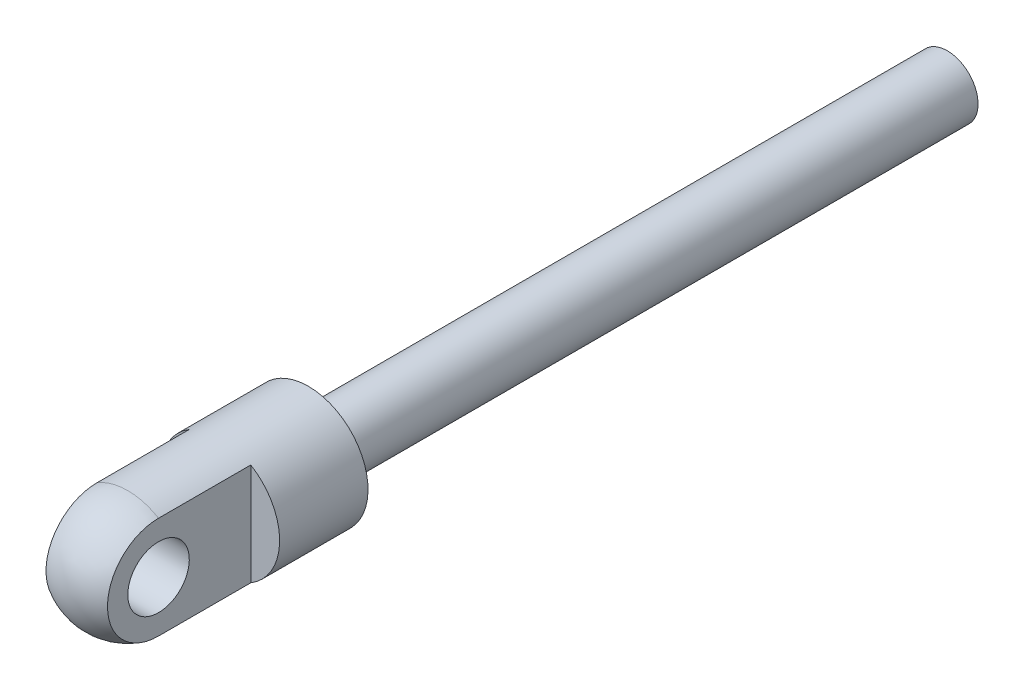
ISO-10303-21;
HEADER;
FILE_DESCRIPTION(('STEP AP214'),'2;1');
FILE_NAME('part.step','',(''),(''),'','','');
FILE_SCHEMA(('AUTOMOTIVE_DESIGN { 1 0 10303 214 1 1 1 1 }'));
ENDSEC;
DATA;
#1=APPLICATION_CONTEXT('core data for automotive mechanical design processes');
#2=APPLICATION_PROTOCOL_DEFINITION('international standard','automotive_design',2000,#1);
#3=PRODUCT_CONTEXT('',#1,'mechanical');
#4=PRODUCT('Part','Part','',(#3));
#5=PRODUCT_RELATED_PRODUCT_CATEGORY('part','',(#4));
#6=PRODUCT_DEFINITION_FORMATION('','',#4);
#7=PRODUCT_DEFINITION_CONTEXT('part definition',#1,'design');
#8=PRODUCT_DEFINITION('design','',#6,#7);
#9=PRODUCT_DEFINITION_SHAPE('','',#8);
#10=(LENGTH_UNIT() NAMED_UNIT(*) SI_UNIT(.MILLI.,.METRE.));
#11=(NAMED_UNIT(*) PLANE_ANGLE_UNIT() SI_UNIT($,.RADIAN.));
#12=(NAMED_UNIT(*) SI_UNIT($,.STERADIAN.) SOLID_ANGLE_UNIT());
#13=UNCERTAINTY_MEASURE_WITH_UNIT(LENGTH_MEASURE(1.E-05),#10,'distance_accuracy_value','');
#14=(GEOMETRIC_REPRESENTATION_CONTEXT(3) GLOBAL_UNCERTAINTY_ASSIGNED_CONTEXT((#13)) GLOBAL_UNIT_ASSIGNED_CONTEXT((#10,
#11,#12)) REPRESENTATION_CONTEXT('',''));
#15=CARTESIAN_POINT('',(0.,0.,0.));
#16=DIRECTION('',(0.,0.,1.));
#17=DIRECTION('',(1.,0.,0.));
#18=AXIS2_PLACEMENT_3D('',#15,#16,#17);
#19=CARTESIAN_POINT('',(0.,0.,28.956));
#20=DIRECTION('',(0.,0.,-1.));
#21=DIRECTION('',(0.,1.,0.));
#22=AXIS2_PLACEMENT_3D('',#19,#20,#21);
#23=CYLINDRICAL_SURFACE('',#22,3.937);
#24=CARTESIAN_POINT('',(0.,0.,25.019));
#25=DIRECTION('',(0.,0.,-1.));
#26=DIRECTION('',(0.,1.,0.));
#27=AXIS2_PLACEMENT_3D('',#24,#25,#26);
#28=CIRCLE('',#27,3.937);
#29=CARTESIAN_POINT('',(-2.032,3.37208318402734,25.019));
#30=VERTEX_POINT('',#29);
#31=CARTESIAN_POINT('',(2.032,3.37208318402734,25.019));
#32=VERTEX_POINT('',#31);
#33=EDGE_CURVE('E57',#30,#32,#28,.T.);
#34=ORIENTED_EDGE('',*,*,#33,.T.);
#35=DIRECTION('',(0.,0.,-1.));
#36=VECTOR('',#35,1.);
#37=CARTESIAN_POINT('',(2.032,3.37208318402734,28.956));
#38=LINE('',#37,#36);
#39=CARTESIAN_POINT('',(2.032,3.37208318402735,18.923));
#40=VERTEX_POINT('',#39);
#41=EDGE_CURVE('E87',#32,#40,#38,.T.);
#42=ORIENTED_EDGE('',*,*,#41,.T.);
#43=CARTESIAN_POINT('',(0.,0.,18.923));
#44=DIRECTION('',(0.,0.,1.));
#45=DIRECTION('',(1.,0.,0.));
#46=AXIS2_PLACEMENT_3D('',#43,#44,#45);
#47=CIRCLE('',#46,3.937);
#48=CARTESIAN_POINT('',(2.032,-3.37208318402734,18.923));
#49=VERTEX_POINT('',#48);
#50=EDGE_CURVE('E39',#40,#49,#47,.F.);
#51=ORIENTED_EDGE('',*,*,#50,.T.);
#52=DIRECTION('',(0.,0.,-1.));
#53=VECTOR('',#52,1.);
#54=CARTESIAN_POINT('',(2.032,-3.37208318402734,28.956));
#55=LINE('',#54,#53);
#56=CARTESIAN_POINT('',(2.032,-3.37208318402734,25.019));
#57=VERTEX_POINT('',#56);
#58=EDGE_CURVE('E78',#49,#57,#55,.F.);
#59=ORIENTED_EDGE('',*,*,#58,.T.);
#60=CARTESIAN_POINT('',(-2.032,-3.37208318402734,25.019));
#61=VERTEX_POINT('',#60);
#62=EDGE_CURVE('E50',#57,#61,#28,.T.);
#63=ORIENTED_EDGE('',*,*,#62,.T.);
#64=DIRECTION('',(0.,0.,-1.));
#65=VECTOR('',#64,1.);
#66=CARTESIAN_POINT('',(-2.032,-3.37208318402735,28.956));
#67=LINE('',#66,#65);
#68=CARTESIAN_POINT('',(-2.032,-3.37208318402734,18.923));
#69=VERTEX_POINT('',#68);
#70=EDGE_CURVE('E112',#61,#69,#67,.T.);
#71=ORIENTED_EDGE('',*,*,#70,.T.);
#72=CARTESIAN_POINT('',(-2.032,3.37208318402735,18.923));
#73=VERTEX_POINT('',#72);
#74=EDGE_CURVE('E12',#69,#73,#47,.F.);
#75=ORIENTED_EDGE('',*,*,#74,.T.);
#76=DIRECTION('',(0.,0.,-1.));
#77=VECTOR('',#76,1.);
#78=CARTESIAN_POINT('',(-2.032,3.37208318402735,28.956));
#79=LINE('',#78,#77);
#80=EDGE_CURVE('E115',#73,#30,#79,.F.);
#81=ORIENTED_EDGE('',*,*,#80,.T.);
#82=EDGE_LOOP('',(#34,#42,#51,#59,#63,#71,#75,#81));
#83=FACE_BOUND('',#82,.T.);
#84=CARTESIAN_POINT('',(0.,0.,13.081));
#85=DIRECTION('',(0.,0.,-1.));
#86=DIRECTION('',(0.,1.,0.));
#87=AXIS2_PLACEMENT_3D('',#84,#85,#86);
#88=CIRCLE('',#87,3.937);
#89=CARTESIAN_POINT('',(0.,3.937,13.081));
#90=VERTEX_POINT('',#89);
#91=EDGE_CURVE('E102',#90,#90,#88,.T.);
#92=ORIENTED_EDGE('',*,*,#91,.F.);
#93=EDGE_LOOP('',(#92));
#94=FACE_BOUND('',#93,.T.);
#95=ADVANCED_FACE('F35',(#83,#94),#23,.T.);
#96=CARTESIAN_POINT('',(0.,0.,25.019));
#97=DIRECTION('',(0.,0.,-1.));
#98=DIRECTION('',(0.,1.,0.));
#99=AXIS2_PLACEMENT_3D('',#96,#97,#98);
#100=SPHERICAL_SURFACE('',#99,3.937);
#101=ORIENTED_EDGE('',*,*,#33,.F.);
#102=CARTESIAN_POINT('',(-2.032,0.,25.019));
#103=DIRECTION('',(-1.,0.,0.));
#104=DIRECTION('',(0.,0.,1.));
#105=AXIS2_PLACEMENT_3D('',#102,#103,#104);
#106=CIRCLE('',#105,3.37208318402734);
#107=EDGE_CURVE('E108',#30,#61,#106,.F.);
#108=ORIENTED_EDGE('',*,*,#107,.T.);
#109=ORIENTED_EDGE('',*,*,#62,.F.);
#110=CARTESIAN_POINT('',(2.032,0.,25.019));
#111=DIRECTION('',(1.,0.,0.));
#112=DIRECTION('',(0.,1.,0.));
#113=AXIS2_PLACEMENT_3D('',#110,#111,#112);
#114=CIRCLE('',#113,3.37208318402734);
#115=EDGE_CURVE('E84',#57,#32,#114,.F.);
#116=ORIENTED_EDGE('',*,*,#115,.T.);
#117=EDGE_LOOP('',(#101,#108,#109,#116));
#118=FACE_BOUND('',#117,.T.);
#119=ADVANCED_FACE('F125',(#118),#100,.T.);
#120=CARTESIAN_POINT('',(0.,2.032,-29.1338));
#121=DIRECTION('',(0.,0.,-1.));
#122=DIRECTION('',(-1.,0.,0.));
#123=AXIS2_PLACEMENT_3D('',#120,#121,#122);
#124=PLANE('',#123);
#125=CARTESIAN_POINT('',(0.,0.,-29.1338));
#126=DIRECTION('',(0.,0.,-1.));
#127=DIRECTION('',(-1.,0.,0.));
#128=AXIS2_PLACEMENT_3D('',#125,#126,#127);
#129=CIRCLE('',#128,2.032);
#130=CARTESIAN_POINT('',(-2.032,0.,-29.1338));
#131=VERTEX_POINT('',#130);
#132=EDGE_CURVE('E95',#131,#131,#129,.T.);
#133=ORIENTED_EDGE('',*,*,#132,.T.);
#134=EDGE_LOOP('',(#133));
#135=FACE_BOUND('',#134,.T.);
#136=ADVANCED_FACE('F37',(#135),#124,.T.);
#137=CARTESIAN_POINT('',(0.,0.,13.081));
#138=DIRECTION('',(0.,0.,-1.));
#139=DIRECTION('',(-1.,0.,0.));
#140=AXIS2_PLACEMENT_3D('',#137,#138,#139);
#141=CYLINDRICAL_SURFACE('',#140,2.032);
#142=CARTESIAN_POINT('',(0.,0.,13.081));
#143=DIRECTION('',(0.,0.,-1.));
#144=DIRECTION('',(0.,1.,0.));
#145=AXIS2_PLACEMENT_3D('',#142,#143,#144);
#146=CIRCLE('',#145,2.032);
#147=CARTESIAN_POINT('',(0.,2.032,13.081));
#148=VERTEX_POINT('',#147);
#149=EDGE_CURVE('E97',#148,#148,#146,.F.);
#150=ORIENTED_EDGE('',*,*,#149,.F.);
#151=EDGE_LOOP('',(#150));
#152=FACE_BOUND('',#151,.T.);
#153=ORIENTED_EDGE('',*,*,#132,.F.);
#154=EDGE_LOOP('',(#153));
#155=FACE_BOUND('',#154,.T.);
#156=ADVANCED_FACE('F134',(#152,#155),#141,.T.);
#157=CARTESIAN_POINT('',(0.,0.,13.081));
#158=DIRECTION('',(0.,0.,-1.));
#159=DIRECTION('',(0.,1.,0.));
#160=AXIS2_PLACEMENT_3D('',#157,#158,#159);
#161=PLANE('',#160);
#162=ORIENTED_EDGE('',*,*,#149,.T.);
#163=EDGE_LOOP('',(#162));
#164=FACE_BOUND('',#163,.T.);
#165=ORIENTED_EDGE('',*,*,#91,.T.);
#166=EDGE_LOOP('',(#165));
#167=FACE_BOUND('',#166,.T.);
#168=ADVANCED_FACE('F123',(#164,#167),#161,.T.);
#169=CARTESIAN_POINT('',(2.032,3.937,18.923));
#170=DIRECTION('',(1.,0.,0.));
#171=DIRECTION('',(0.,1.,0.));
#172=AXIS2_PLACEMENT_3D('',#169,#170,#171);
#173=PLANE('',#172);
#174=DIRECTION('',(0.,1.,0.));
#175=VECTOR('',#174,1.);
#176=CARTESIAN_POINT('',(2.032,3.937,18.923));
#177=LINE('',#176,#175);
#178=EDGE_CURVE('E82',#49,#40,#177,.T.);
#179=ORIENTED_EDGE('',*,*,#178,.T.);
#180=ORIENTED_EDGE('',*,*,#41,.F.);
#181=ORIENTED_EDGE('',*,*,#115,.F.);
#182=ORIENTED_EDGE('',*,*,#58,.F.);
#183=EDGE_LOOP('',(#179,#180,#181,#182));
#184=FACE_BOUND('',#183,.T.);
#185=CARTESIAN_POINT('',(2.032,0.,25.019));
#186=DIRECTION('',(1.,0.,0.));
#187=DIRECTION('',(0.,1.,0.));
#188=AXIS2_PLACEMENT_3D('',#185,#186,#187);
#189=CIRCLE('',#188,2.03200000000001);
#190=CARTESIAN_POINT('',(2.032,2.03200000000001,25.019));
#191=VERTEX_POINT('',#190);
#192=EDGE_CURVE('E91',#191,#191,#189,.F.);
#193=ORIENTED_EDGE('',*,*,#192,.T.);
#194=EDGE_LOOP('',(#193));
#195=FACE_BOUND('',#194,.T.);
#196=ADVANCED_FACE('F80',(#184,#195),#173,.T.);
#197=CARTESIAN_POINT('',(0.,0.,18.923));
#198=DIRECTION('',(0.,0.,1.));
#199=DIRECTION('',(1.,0.,0.));
#200=AXIS2_PLACEMENT_3D('',#197,#198,#199);
#201=PLANE('',#200);
#202=ORIENTED_EDGE('',*,*,#178,.F.);
#203=ORIENTED_EDGE('',*,*,#50,.F.);
#204=EDGE_LOOP('',(#202,#203));
#205=FACE_BOUND('',#204,.T.);
#206=ADVANCED_FACE('F90',(#205),#201,.T.);
#207=DIRECTION('',(0.,-1.,0.));
#208=VECTOR('',#207,1.);
#209=CARTESIAN_POINT('',(-2.032,3.937,18.923));
#210=LINE('',#209,#208);
#211=EDGE_CURVE('E92',#73,#69,#210,.T.);
#212=ORIENTED_EDGE('',*,*,#211,.F.);
#213=ORIENTED_EDGE('',*,*,#74,.F.);
#214=EDGE_LOOP('',(#212,#213));
#215=FACE_BOUND('',#214,.T.);
#216=ADVANCED_FACE('F181',(#215),#201,.T.);
#217=CARTESIAN_POINT('',(-2.032,3.937,18.923));
#218=DIRECTION('',(-1.,0.,0.));
#219=DIRECTION('',(0.,0.,1.));
#220=AXIS2_PLACEMENT_3D('',#217,#218,#219);
#221=PLANE('',#220);
#222=ORIENTED_EDGE('',*,*,#211,.T.);
#223=ORIENTED_EDGE('',*,*,#70,.F.);
#224=ORIENTED_EDGE('',*,*,#107,.F.);
#225=ORIENTED_EDGE('',*,*,#80,.F.);
#226=EDGE_LOOP('',(#222,#223,#224,#225));
#227=FACE_BOUND('',#226,.T.);
#228=CARTESIAN_POINT('',(-2.032,0.,25.019));
#229=DIRECTION('',(-1.,0.,0.));
#230=DIRECTION('',(0.,0.,1.));
#231=AXIS2_PLACEMENT_3D('',#228,#229,#230);
#232=CIRCLE('',#231,2.03200000000001);
#233=CARTESIAN_POINT('',(-2.032,0.,27.051));
#234=VERTEX_POINT('',#233);
#235=EDGE_CURVE('E86',#234,#234,#232,.F.);
#236=ORIENTED_EDGE('',*,*,#235,.T.);
#237=EDGE_LOOP('',(#236));
#238=FACE_BOUND('',#237,.T.);
#239=ADVANCED_FACE('F189',(#227,#238),#221,.T.);
#240=CARTESIAN_POINT('',(-5.969,0.,25.019));
#241=DIRECTION('',(1.,0.,0.));
#242=DIRECTION('',(0.,0.,-1.));
#243=AXIS2_PLACEMENT_3D('',#240,#241,#242);
#244=CYLINDRICAL_SURFACE('',#243,2.03200000000001);
#245=ORIENTED_EDGE('',*,*,#192,.F.);
#246=EDGE_LOOP('',(#245));
#247=FACE_BOUND('',#246,.T.);
#248=ORIENTED_EDGE('',*,*,#235,.F.);
#249=EDGE_LOOP('',(#248));
#250=FACE_BOUND('',#249,.T.);
#251=ADVANCED_FACE('F197',(#247,#250),#244,.F.);
#252=CLOSED_SHELL('',(#95,#119,#136,#156,#168,#196,#206,#216,#239,#251));
#253=MANIFOLD_SOLID_BREP('B2',#252);
#254=ADVANCED_BREP_SHAPE_REPRESENTATION('',(#18,#253),#14);
#255=SHAPE_DEFINITION_REPRESENTATION(#9,#254);
ENDSEC;
END-ISO-10303-21;
